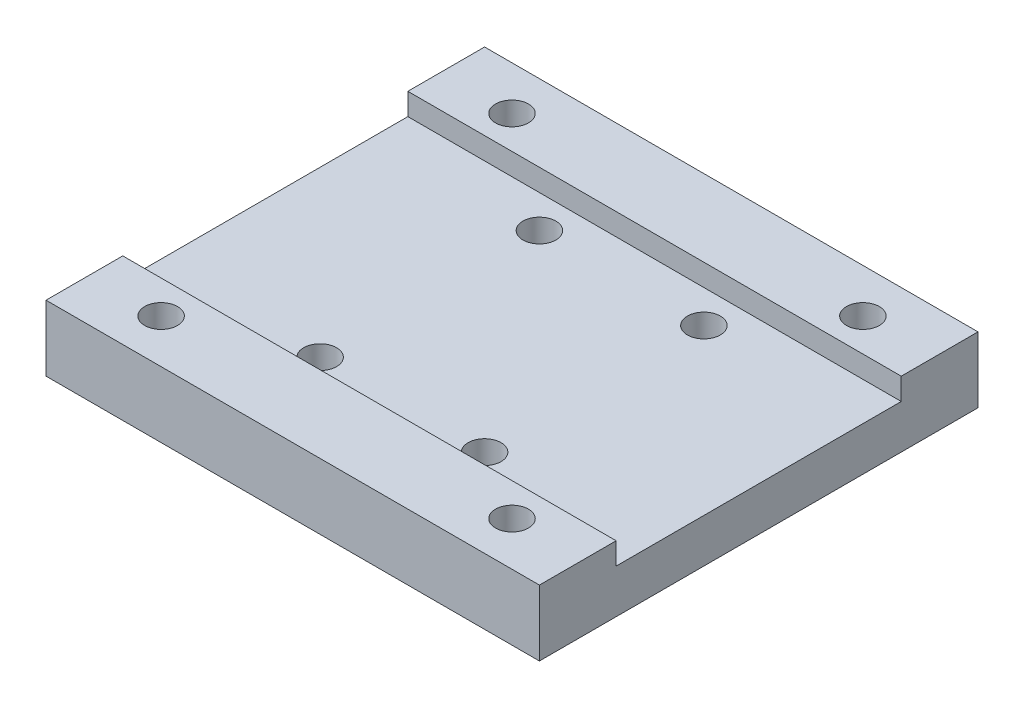
ISO-10303-21;
HEADER;
FILE_DESCRIPTION(('STEP AP214'),'2;1');
FILE_NAME('part.step','',(''),(''),'','','');
FILE_SCHEMA(('AUTOMOTIVE_DESIGN { 1 0 10303 214 1 1 1 1 }'));
ENDSEC;
DATA;
#1=APPLICATION_CONTEXT('core data for automotive mechanical design processes');
#2=APPLICATION_PROTOCOL_DEFINITION('international standard','automotive_design',2000,#1);
#3=PRODUCT_CONTEXT('',#1,'mechanical');
#4=PRODUCT('Part','Part','',(#3));
#5=PRODUCT_RELATED_PRODUCT_CATEGORY('part','',(#4));
#6=PRODUCT_DEFINITION_FORMATION('','',#4);
#7=PRODUCT_DEFINITION_CONTEXT('part definition',#1,'design');
#8=PRODUCT_DEFINITION('design','',#6,#7);
#9=PRODUCT_DEFINITION_SHAPE('','',#8);
#10=(LENGTH_UNIT() NAMED_UNIT(*) SI_UNIT(.MILLI.,.METRE.));
#11=(NAMED_UNIT(*) PLANE_ANGLE_UNIT() SI_UNIT($,.RADIAN.));
#12=(NAMED_UNIT(*) SI_UNIT($,.STERADIAN.) SOLID_ANGLE_UNIT());
#13=UNCERTAINTY_MEASURE_WITH_UNIT(LENGTH_MEASURE(1.E-05),#10,'distance_accuracy_value','');
#14=(GEOMETRIC_REPRESENTATION_CONTEXT(3) GLOBAL_UNCERTAINTY_ASSIGNED_CONTEXT((#13)) GLOBAL_UNIT_ASSIGNED_CONTEXT((#10,
#11,#12)) REPRESENTATION_CONTEXT('',''));
#15=CARTESIAN_POINT('',(0.,0.,0.));
#16=DIRECTION('',(0.,0.,1.));
#17=DIRECTION('',(1.,0.,0.));
#18=AXIS2_PLACEMENT_3D('',#15,#16,#17);
#19=CARTESIAN_POINT('',(0.,6.,0.));
#20=DIRECTION('',(0.,1.,0.));
#21=DIRECTION('',(0.,0.,1.));
#22=AXIS2_PLACEMENT_3D('',#19,#20,#21);
#23=PLANE('',#22);
#24=CARTESIAN_POINT('',(16.,6.,16.));
#25=DIRECTION('',(0.,1.,0.));
#26=DIRECTION('',(0.,0.,1.));
#27=AXIS2_PLACEMENT_3D('',#24,#25,#26);
#28=CIRCLE('',#27,1.5);
#29=CARTESIAN_POINT('',(16.,6.,17.5));
#30=VERTEX_POINT('',#29);
#31=EDGE_CURVE('E155',#30,#30,#28,.T.);
#32=ORIENTED_EDGE('',*,*,#31,.F.);
#33=EDGE_LOOP('',(#32));
#34=FACE_BOUND('',#33,.T.);
#35=CARTESIAN_POINT('',(-16.,6.,16.));
#36=DIRECTION('',(0.,1.,0.));
#37=DIRECTION('',(0.,0.,1.));
#38=AXIS2_PLACEMENT_3D('',#35,#36,#37);
#39=CIRCLE('',#38,1.5);
#40=CARTESIAN_POINT('',(-16.,6.,17.5));
#41=VERTEX_POINT('',#40);
#42=EDGE_CURVE('E158',#41,#41,#39,.T.);
#43=ORIENTED_EDGE('',*,*,#42,.F.);
#44=EDGE_LOOP('',(#43));
#45=FACE_BOUND('',#44,.T.);
#46=DIRECTION('',(0.,0.,-1.));
#47=VECTOR('',#46,1.);
#48=CARTESIAN_POINT('',(22.5,6.,16.5));
#49=LINE('',#48,#47);
#50=CARTESIAN_POINT('',(22.5,6.,20.));
#51=VERTEX_POINT('',#50);
#52=CARTESIAN_POINT('',(22.5,6.,13.));
#53=VERTEX_POINT('',#52);
#54=EDGE_CURVE('E11',#51,#53,#49,.T.);
#55=ORIENTED_EDGE('',*,*,#54,.T.);
#56=DIRECTION('',(1.,0.,0.));
#57=VECTOR('',#56,1.);
#58=CARTESIAN_POINT('',(22.5,6.,13.));
#59=LINE('',#58,#57);
#60=CARTESIAN_POINT('',(-22.5,6.,13.));
#61=VERTEX_POINT('',#60);
#62=EDGE_CURVE('E162',#61,#53,#59,.T.);
#63=ORIENTED_EDGE('',*,*,#62,.F.);
#64=DIRECTION('',(0.,0.,1.));
#65=VECTOR('',#64,1.);
#66=CARTESIAN_POINT('',(-22.5,6.,-16.5));
#67=LINE('',#66,#65);
#68=CARTESIAN_POINT('',(-22.5,6.,20.));
#69=VERTEX_POINT('',#68);
#70=EDGE_CURVE('E231',#61,#69,#67,.T.);
#71=ORIENTED_EDGE('',*,*,#70,.T.);
#72=DIRECTION('',(-1.,0.,0.));
#73=VECTOR('',#72,1.);
#74=CARTESIAN_POINT('',(22.5,6.,20.));
#75=LINE('',#74,#73);
#76=EDGE_CURVE('E194',#51,#69,#75,.T.);
#77=ORIENTED_EDGE('',*,*,#76,.F.);
#78=EDGE_LOOP('',(#55,#63,#71,#77));
#79=FACE_BOUND('',#78,.T.);
#80=ADVANCED_FACE('F39',(#34,#45,#79),#23,.T.);
#81=CARTESIAN_POINT('',(-16.,6.,-16.));
#82=DIRECTION('',(0.,1.,0.));
#83=DIRECTION('',(0.,0.,1.));
#84=AXIS2_PLACEMENT_3D('',#81,#82,#83);
#85=CIRCLE('',#84,1.5);
#86=CARTESIAN_POINT('',(-16.,6.,-14.5));
#87=VERTEX_POINT('',#86);
#88=EDGE_CURVE('E149',#87,#87,#85,.T.);
#89=ORIENTED_EDGE('',*,*,#88,.F.);
#90=EDGE_LOOP('',(#89));
#91=FACE_BOUND('',#90,.T.);
#92=CARTESIAN_POINT('',(16.,6.,-16.));
#93=DIRECTION('',(0.,1.,0.));
#94=DIRECTION('',(0.,0.,1.));
#95=AXIS2_PLACEMENT_3D('',#92,#93,#94);
#96=CIRCLE('',#95,1.5);
#97=CARTESIAN_POINT('',(16.,6.,-14.5));
#98=VERTEX_POINT('',#97);
#99=EDGE_CURVE('E152',#98,#98,#96,.T.);
#100=ORIENTED_EDGE('',*,*,#99,.F.);
#101=EDGE_LOOP('',(#100));
#102=FACE_BOUND('',#101,.T.);
#103=CARTESIAN_POINT('',(-22.5,6.,-20.));
#104=VERTEX_POINT('',#103);
#105=CARTESIAN_POINT('',(-22.5,6.,-13.));
#106=VERTEX_POINT('',#105);
#107=EDGE_CURVE('E230',#104,#106,#67,.T.);
#108=ORIENTED_EDGE('',*,*,#107,.T.);
#109=DIRECTION('',(-1.,0.,0.));
#110=VECTOR('',#109,1.);
#111=CARTESIAN_POINT('',(-22.5,6.,-13.));
#112=LINE('',#111,#110);
#113=CARTESIAN_POINT('',(22.5,6.,-13.));
#114=VERTEX_POINT('',#113);
#115=EDGE_CURVE('E172',#114,#106,#112,.T.);
#116=ORIENTED_EDGE('',*,*,#115,.F.);
#117=CARTESIAN_POINT('',(22.5,6.,-20.));
#118=VERTEX_POINT('',#117);
#119=EDGE_CURVE('E48',#114,#118,#49,.T.);
#120=ORIENTED_EDGE('',*,*,#119,.T.);
#121=DIRECTION('',(1.,0.,0.));
#122=VECTOR('',#121,1.);
#123=CARTESIAN_POINT('',(-22.5,6.,-20.));
#124=LINE('',#123,#122);
#125=EDGE_CURVE('E206',#104,#118,#124,.T.);
#126=ORIENTED_EDGE('',*,*,#125,.F.);
#127=EDGE_LOOP('',(#108,#116,#120,#126));
#128=FACE_BOUND('',#127,.T.);
#129=ADVANCED_FACE('F257',(#91,#102,#128),#23,.T.);
#130=CARTESIAN_POINT('',(0.,0.,0.));
#131=DIRECTION('',(0.,1.,0.));
#132=DIRECTION('',(0.,0.,1.));
#133=AXIS2_PLACEMENT_3D('',#130,#131,#132);
#134=PLANE('',#133);
#135=CARTESIAN_POINT('',(16.,0.,-16.));
#136=DIRECTION('',(0.,-1.,0.));
#137=DIRECTION('',(0.,0.,-1.));
#138=AXIS2_PLACEMENT_3D('',#135,#136,#137);
#139=CIRCLE('',#138,3.);
#140=CARTESIAN_POINT('',(16.,0.,-19.));
#141=VERTEX_POINT('',#140);
#142=EDGE_CURVE('E623',#141,#141,#139,.T.);
#143=ORIENTED_EDGE('',*,*,#142,.F.);
#144=EDGE_LOOP('',(#143));
#145=FACE_BOUND('',#144,.T.);
#146=CARTESIAN_POINT('',(-16.,0.,-16.));
#147=DIRECTION('',(0.,-1.,0.));
#148=DIRECTION('',(0.,0.,-1.));
#149=AXIS2_PLACEMENT_3D('',#146,#147,#148);
#150=CIRCLE('',#149,3.);
#151=CARTESIAN_POINT('',(-16.,0.,-19.));
#152=VERTEX_POINT('',#151);
#153=EDGE_CURVE('E630',#152,#152,#150,.T.);
#154=ORIENTED_EDGE('',*,*,#153,.F.);
#155=EDGE_LOOP('',(#154));
#156=FACE_BOUND('',#155,.T.);
#157=CARTESIAN_POINT('',(-16.,0.,16.));
#158=DIRECTION('',(0.,-1.,0.));
#159=DIRECTION('',(0.,0.,-1.));
#160=AXIS2_PLACEMENT_3D('',#157,#158,#159);
#161=CIRCLE('',#160,3.);
#162=CARTESIAN_POINT('',(-16.,0.,13.));
#163=VERTEX_POINT('',#162);
#164=EDGE_CURVE('E639',#163,#163,#161,.T.);
#165=ORIENTED_EDGE('',*,*,#164,.F.);
#166=EDGE_LOOP('',(#165));
#167=FACE_BOUND('',#166,.T.);
#168=CARTESIAN_POINT('',(16.,0.,16.));
#169=DIRECTION('',(0.,-1.,0.));
#170=DIRECTION('',(0.,0.,-1.));
#171=AXIS2_PLACEMENT_3D('',#168,#169,#170);
#172=CIRCLE('',#171,3.);
#173=CARTESIAN_POINT('',(16.,0.,13.));
#174=VERTEX_POINT('',#173);
#175=EDGE_CURVE('E648',#174,#174,#172,.T.);
#176=ORIENTED_EDGE('',*,*,#175,.F.);
#177=EDGE_LOOP('',(#176));
#178=FACE_BOUND('',#177,.T.);
#179=CARTESIAN_POINT('',(-3.50000000000004,0.,17.));
#180=DIRECTION('',(0.,-1.,0.));
#181=DIRECTION('',(0.,0.,-1.));
#182=AXIS2_PLACEMENT_3D('',#179,#180,#181);
#183=CIRCLE('',#182,1.24999999999999);
#184=CARTESIAN_POINT('',(-3.50000000000004,0.,15.75));
#185=VERTEX_POINT('',#184);
#186=EDGE_CURVE('E125',#185,#185,#183,.T.);
#187=ORIENTED_EDGE('',*,*,#186,.F.);
#188=EDGE_LOOP('',(#187));
#189=FACE_BOUND('',#188,.T.);
#190=CARTESIAN_POINT('',(3.49999999999996,0.,17.));
#191=DIRECTION('',(0.,-1.,0.));
#192=DIRECTION('',(0.,0.,-1.));
#193=AXIS2_PLACEMENT_3D('',#190,#191,#192);
#194=CIRCLE('',#193,1.24999999999999);
#195=CARTESIAN_POINT('',(3.49999999999996,0.,15.75));
#196=VERTEX_POINT('',#195);
#197=EDGE_CURVE('E124',#196,#196,#194,.T.);
#198=ORIENTED_EDGE('',*,*,#197,.F.);
#199=EDGE_LOOP('',(#198));
#200=FACE_BOUND('',#199,.T.);
#201=CARTESIAN_POINT('',(3.49999999999996,0.,-16.9999999999999));
#202=DIRECTION('',(0.,-1.,0.));
#203=DIRECTION('',(0.,0.,-1.));
#204=AXIS2_PLACEMENT_3D('',#201,#202,#203);
#205=CIRCLE('',#204,1.24999999999999);
#206=CARTESIAN_POINT('',(3.49999999999996,0.,-18.2499999999999));
#207=VERTEX_POINT('',#206);
#208=EDGE_CURVE('E137',#207,#207,#205,.T.);
#209=ORIENTED_EDGE('',*,*,#208,.F.);
#210=EDGE_LOOP('',(#209));
#211=FACE_BOUND('',#210,.T.);
#212=CARTESIAN_POINT('',(-3.50000000000003,0.,-16.9999999999999));
#213=DIRECTION('',(0.,-1.,0.));
#214=DIRECTION('',(0.,0.,-1.));
#215=AXIS2_PLACEMENT_3D('',#212,#213,#214);
#216=CIRCLE('',#215,1.24999999999999);
#217=CARTESIAN_POINT('',(-3.50000000000003,0.,-18.2499999999999));
#218=VERTEX_POINT('',#217);
#219=EDGE_CURVE('E143',#218,#218,#216,.T.);
#220=ORIENTED_EDGE('',*,*,#219,.F.);
#221=EDGE_LOOP('',(#220));
#222=FACE_BOUND('',#221,.T.);
#223=DIRECTION('',(0.,0.,1.));
#224=VECTOR('',#223,1.);
#225=CARTESIAN_POINT('',(-22.5,0.,-16.5));
#226=LINE('',#225,#224);
#227=CARTESIAN_POINT('',(-22.5,0.,-20.));
#228=VERTEX_POINT('',#227);
#229=CARTESIAN_POINT('',(-22.5,0.,20.));
#230=VERTEX_POINT('',#229);
#231=EDGE_CURVE('E229',#228,#230,#226,.T.);
#232=ORIENTED_EDGE('',*,*,#231,.F.);
#233=DIRECTION('',(1.,0.,0.));
#234=VECTOR('',#233,1.);
#235=CARTESIAN_POINT('',(-22.5,0.,-20.));
#236=LINE('',#235,#234);
#237=CARTESIAN_POINT('',(22.5,0.,-20.));
#238=VERTEX_POINT('',#237);
#239=EDGE_CURVE('E203',#228,#238,#236,.T.);
#240=ORIENTED_EDGE('',*,*,#239,.T.);
#241=DIRECTION('',(0.,0.,-1.));
#242=VECTOR('',#241,1.);
#243=CARTESIAN_POINT('',(22.5,0.,16.5));
#244=LINE('',#243,#242);
#245=CARTESIAN_POINT('',(22.5,0.,20.));
#246=VERTEX_POINT('',#245);
#247=EDGE_CURVE('E233',#246,#238,#244,.T.);
#248=ORIENTED_EDGE('',*,*,#247,.F.);
#249=DIRECTION('',(-1.,0.,0.));
#250=VECTOR('',#249,1.);
#251=CARTESIAN_POINT('',(22.5,0.,20.));
#252=LINE('',#251,#250);
#253=EDGE_CURVE('E193',#246,#230,#252,.T.);
#254=ORIENTED_EDGE('',*,*,#253,.T.);
#255=EDGE_LOOP('',(#232,#240,#248,#254));
#256=FACE_BOUND('',#255,.T.);
#257=CARTESIAN_POINT('',(-7.49999999999996,0.,-10.));
#258=DIRECTION('',(0.,1.,0.));
#259=DIRECTION('',(0.,0.,1.));
#260=AXIS2_PLACEMENT_3D('',#257,#258,#259);
#261=CIRCLE('',#260,1.5);
#262=CARTESIAN_POINT('',(-7.49999999999996,0.,-8.50000000000001));
#263=VERTEX_POINT('',#262);
#264=EDGE_CURVE('E226',#263,#263,#261,.T.);
#265=ORIENTED_EDGE('',*,*,#264,.T.);
#266=EDGE_LOOP('',(#265));
#267=FACE_BOUND('',#266,.T.);
#268=CARTESIAN_POINT('',(7.50000000000004,0.,-10.));
#269=DIRECTION('',(0.,1.,0.));
#270=DIRECTION('',(0.,0.,1.));
#271=AXIS2_PLACEMENT_3D('',#268,#269,#270);
#272=CIRCLE('',#271,1.5);
#273=CARTESIAN_POINT('',(7.50000000000004,0.,-8.50000000000001));
#274=VERTEX_POINT('',#273);
#275=EDGE_CURVE('E223',#274,#274,#272,.T.);
#276=ORIENTED_EDGE('',*,*,#275,.T.);
#277=EDGE_LOOP('',(#276));
#278=FACE_BOUND('',#277,.T.);
#279=CARTESIAN_POINT('',(-7.5,0.,10.));
#280=DIRECTION('',(0.,1.,0.));
#281=DIRECTION('',(0.,0.,1.));
#282=AXIS2_PLACEMENT_3D('',#279,#280,#281);
#283=CIRCLE('',#282,1.5);
#284=CARTESIAN_POINT('',(-7.5,0.,11.5));
#285=VERTEX_POINT('',#284);
#286=EDGE_CURVE('E220',#285,#285,#283,.T.);
#287=ORIENTED_EDGE('',*,*,#286,.T.);
#288=EDGE_LOOP('',(#287));
#289=FACE_BOUND('',#288,.T.);
#290=CARTESIAN_POINT('',(7.5,0.,10.));
#291=DIRECTION('',(0.,1.,0.));
#292=DIRECTION('',(0.,0.,1.));
#293=AXIS2_PLACEMENT_3D('',#290,#291,#292);
#294=CIRCLE('',#293,1.5);
#295=CARTESIAN_POINT('',(7.5,0.,11.5));
#296=VERTEX_POINT('',#295);
#297=EDGE_CURVE('E215',#296,#296,#294,.T.);
#298=ORIENTED_EDGE('',*,*,#297,.T.);
#299=EDGE_LOOP('',(#298));
#300=FACE_BOUND('',#299,.T.);
#301=ADVANCED_FACE('F264',(#145,#156,#167,#178,#189,#200,#211,#222,#256,#267,#278,#289,#300),
#134,.F.);
#302=CARTESIAN_POINT('',(-22.5,6.,-16.5));
#303=DIRECTION('',(1.,0.,0.));
#304=DIRECTION('',(0.,0.,-1.));
#305=AXIS2_PLACEMENT_3D('',#302,#303,#304);
#306=PLANE('',#305);
#307=ORIENTED_EDGE('',*,*,#70,.F.);
#308=DIRECTION('',(0.,-1.,0.));
#309=VECTOR('',#308,1.);
#310=CARTESIAN_POINT('',(-22.5,51.13590588434,13.));
#311=LINE('',#310,#309);
#312=CARTESIAN_POINT('',(-22.5,4.,13.));
#313=VERTEX_POINT('',#312);
#314=EDGE_CURVE('E168',#61,#313,#311,.T.);
#315=ORIENTED_EDGE('',*,*,#314,.T.);
#316=DIRECTION('',(0.,0.,1.));
#317=VECTOR('',#316,1.);
#318=CARTESIAN_POINT('',(-22.5,4.,13.75));
#319=LINE('',#318,#317);
#320=CARTESIAN_POINT('',(-22.5,4.,-13.));
#321=VERTEX_POINT('',#320);
#322=EDGE_CURVE('E56',#321,#313,#319,.T.);
#323=ORIENTED_EDGE('',*,*,#322,.F.);
#324=DIRECTION('',(0.,-1.,0.));
#325=VECTOR('',#324,1.);
#326=CARTESIAN_POINT('',(-22.5,51.13590588434,-13.));
#327=LINE('',#326,#325);
#328=EDGE_CURVE('E175',#106,#321,#327,.T.);
#329=ORIENTED_EDGE('',*,*,#328,.F.);
#330=ORIENTED_EDGE('',*,*,#107,.F.);
#331=DIRECTION('',(0.,-1.,0.));
#332=VECTOR('',#331,1.);
#333=CARTESIAN_POINT('',(-22.5,6.,-20.));
#334=LINE('',#333,#332);
#335=EDGE_CURVE('E209',#104,#228,#334,.T.);
#336=ORIENTED_EDGE('',*,*,#335,.T.);
#337=ORIENTED_EDGE('',*,*,#231,.T.);
#338=DIRECTION('',(0.,-1.,0.));
#339=VECTOR('',#338,1.);
#340=CARTESIAN_POINT('',(-22.5,6.,20.));
#341=LINE('',#340,#339);
#342=EDGE_CURVE('E200',#69,#230,#341,.T.);
#343=ORIENTED_EDGE('',*,*,#342,.F.);
#344=EDGE_LOOP('',(#307,#315,#323,#329,#330,#336,#337,#343));
#345=FACE_BOUND('',#344,.T.);
#346=ADVANCED_FACE('F41',(#345),#306,.F.);
#347=CARTESIAN_POINT('',(22.5,6.,16.5));
#348=DIRECTION('',(-1.,0.,0.));
#349=DIRECTION('',(0.,0.,1.));
#350=AXIS2_PLACEMENT_3D('',#347,#348,#349);
#351=PLANE('',#350);
#352=DIRECTION('',(0.,-1.,0.));
#353=VECTOR('',#352,1.);
#354=CARTESIAN_POINT('',(22.5,51.13590588434,13.));
#355=LINE('',#354,#353);
#356=CARTESIAN_POINT('',(22.5,4.,13.));
#357=VERTEX_POINT('',#356);
#358=EDGE_CURVE('E165',#53,#357,#355,.T.);
#359=ORIENTED_EDGE('',*,*,#358,.F.);
#360=ORIENTED_EDGE('',*,*,#54,.F.);
#361=DIRECTION('',(0.,-1.,0.));
#362=VECTOR('',#361,1.);
#363=CARTESIAN_POINT('',(22.5,6.,20.));
#364=LINE('',#363,#362);
#365=EDGE_CURVE('E197',#51,#246,#364,.T.);
#366=ORIENTED_EDGE('',*,*,#365,.T.);
#367=ORIENTED_EDGE('',*,*,#247,.T.);
#368=DIRECTION('',(0.,-1.,0.));
#369=VECTOR('',#368,1.);
#370=CARTESIAN_POINT('',(22.5,6.,-20.));
#371=LINE('',#370,#369);
#372=EDGE_CURVE('E212',#118,#238,#371,.T.);
#373=ORIENTED_EDGE('',*,*,#372,.F.);
#374=ORIENTED_EDGE('',*,*,#119,.F.);
#375=DIRECTION('',(0.,-1.,0.));
#376=VECTOR('',#375,1.);
#377=CARTESIAN_POINT('',(22.5,51.13590588434,-13.));
#378=LINE('',#377,#376);
#379=CARTESIAN_POINT('',(22.5,4.,-13.));
#380=VERTEX_POINT('',#379);
#381=EDGE_CURVE('E178',#114,#380,#378,.T.);
#382=ORIENTED_EDGE('',*,*,#381,.T.);
#383=DIRECTION('',(0.,0.,-1.));
#384=VECTOR('',#383,1.);
#385=CARTESIAN_POINT('',(22.5,4.,-13.75));
#386=LINE('',#385,#384);
#387=EDGE_CURVE('E181',#357,#380,#386,.T.);
#388=ORIENTED_EDGE('',*,*,#387,.F.);
#389=EDGE_LOOP('',(#359,#360,#366,#367,#373,#374,#382,#388));
#390=FACE_BOUND('',#389,.T.);
#391=ADVANCED_FACE('F247',(#390),#351,.F.);
#392=CARTESIAN_POINT('',(-7.49999999999996,6.,-10.));
#393=DIRECTION('',(0.,-1.,0.));
#394=DIRECTION('',(0.,0.,-1.));
#395=AXIS2_PLACEMENT_3D('',#392,#393,#394);
#396=CYLINDRICAL_SURFACE('',#395,1.5);
#397=CARTESIAN_POINT('',(-7.49999999999996,4.,-10.));
#398=DIRECTION('',(0.,-1.,0.));
#399=DIRECTION('',(0.,0.,-1.));
#400=AXIS2_PLACEMENT_3D('',#397,#398,#399);
#401=CIRCLE('',#400,1.5);
#402=CARTESIAN_POINT('',(-7.49999999999996,4.,-11.5));
#403=VERTEX_POINT('',#402);
#404=EDGE_CURVE('E190',#403,#403,#401,.T.);
#405=ORIENTED_EDGE('',*,*,#404,.F.);
#406=EDGE_LOOP('',(#405));
#407=FACE_BOUND('',#406,.T.);
#408=ORIENTED_EDGE('',*,*,#264,.F.);
#409=EDGE_LOOP('',(#408));
#410=FACE_BOUND('',#409,.T.);
#411=ADVANCED_FACE('F301',(#407,#410),#396,.F.);
#412=CARTESIAN_POINT('',(7.50000000000004,6.,-10.));
#413=DIRECTION('',(0.,-1.,0.));
#414=DIRECTION('',(0.,0.,-1.));
#415=AXIS2_PLACEMENT_3D('',#412,#413,#414);
#416=CYLINDRICAL_SURFACE('',#415,1.5);
#417=CARTESIAN_POINT('',(7.50000000000004,4.,-10.));
#418=DIRECTION('',(0.,-1.,0.));
#419=DIRECTION('',(0.,0.,-1.));
#420=AXIS2_PLACEMENT_3D('',#417,#418,#419);
#421=CIRCLE('',#420,1.5);
#422=CARTESIAN_POINT('',(7.50000000000004,4.,-11.5));
#423=VERTEX_POINT('',#422);
#424=EDGE_CURVE('E187',#423,#423,#421,.T.);
#425=ORIENTED_EDGE('',*,*,#424,.F.);
#426=EDGE_LOOP('',(#425));
#427=FACE_BOUND('',#426,.T.);
#428=ORIENTED_EDGE('',*,*,#275,.F.);
#429=EDGE_LOOP('',(#428));
#430=FACE_BOUND('',#429,.T.);
#431=ADVANCED_FACE('F287',(#427,#430),#416,.F.);
#432=CARTESIAN_POINT('',(-7.5,6.,10.));
#433=DIRECTION('',(0.,-1.,0.));
#434=DIRECTION('',(0.,0.,-1.));
#435=AXIS2_PLACEMENT_3D('',#432,#433,#434);
#436=CYLINDRICAL_SURFACE('',#435,1.5);
#437=CARTESIAN_POINT('',(-7.5,4.,10.));
#438=DIRECTION('',(0.,-1.,0.));
#439=DIRECTION('',(0.,0.,-1.));
#440=AXIS2_PLACEMENT_3D('',#437,#438,#439);
#441=CIRCLE('',#440,1.5);
#442=CARTESIAN_POINT('',(-7.5,4.,8.5));
#443=VERTEX_POINT('',#442);
#444=EDGE_CURVE('E184',#443,#443,#441,.T.);
#445=ORIENTED_EDGE('',*,*,#444,.F.);
#446=EDGE_LOOP('',(#445));
#447=FACE_BOUND('',#446,.T.);
#448=ORIENTED_EDGE('',*,*,#286,.F.);
#449=EDGE_LOOP('',(#448));
#450=FACE_BOUND('',#449,.T.);
#451=ADVANCED_FACE('F279',(#447,#450),#436,.F.);
#452=CARTESIAN_POINT('',(7.5,6.,10.));
#453=DIRECTION('',(0.,-1.,0.));
#454=DIRECTION('',(0.,0.,-1.));
#455=AXIS2_PLACEMENT_3D('',#452,#453,#454);
#456=CYLINDRICAL_SURFACE('',#455,1.5);
#457=CARTESIAN_POINT('',(7.5,4.,10.));
#458=DIRECTION('',(0.,-1.,0.));
#459=DIRECTION('',(0.,0.,-1.));
#460=AXIS2_PLACEMENT_3D('',#457,#458,#459);
#461=CIRCLE('',#460,1.5);
#462=CARTESIAN_POINT('',(7.5,4.,8.5));
#463=VERTEX_POINT('',#462);
#464=EDGE_CURVE('E43',#463,#463,#461,.T.);
#465=ORIENTED_EDGE('',*,*,#464,.F.);
#466=EDGE_LOOP('',(#465));
#467=FACE_BOUND('',#466,.T.);
#468=ORIENTED_EDGE('',*,*,#297,.F.);
#469=EDGE_LOOP('',(#468));
#470=FACE_BOUND('',#469,.T.);
#471=ADVANCED_FACE('F277',(#467,#470),#456,.F.);
#472=CARTESIAN_POINT('',(-22.5,6.,-20.));
#473=DIRECTION('',(0.,0.,-1.));
#474=DIRECTION('',(-1.,0.,0.));
#475=AXIS2_PLACEMENT_3D('',#472,#473,#474);
#476=PLANE('',#475);
#477=ORIENTED_EDGE('',*,*,#239,.F.);
#478=ORIENTED_EDGE('',*,*,#335,.F.);
#479=ORIENTED_EDGE('',*,*,#125,.T.);
#480=ORIENTED_EDGE('',*,*,#372,.T.);
#481=EDGE_LOOP('',(#477,#478,#479,#480));
#482=FACE_BOUND('',#481,.T.);
#483=ADVANCED_FACE('F262',(#482),#476,.T.);
#484=CARTESIAN_POINT('',(22.5,6.,20.));
#485=DIRECTION('',(0.,0.,1.));
#486=DIRECTION('',(1.,0.,0.));
#487=AXIS2_PLACEMENT_3D('',#484,#485,#486);
#488=PLANE('',#487);
#489=ORIENTED_EDGE('',*,*,#253,.F.);
#490=ORIENTED_EDGE('',*,*,#365,.F.);
#491=ORIENTED_EDGE('',*,*,#76,.T.);
#492=ORIENTED_EDGE('',*,*,#342,.T.);
#493=EDGE_LOOP('',(#489,#490,#491,#492));
#494=FACE_BOUND('',#493,.T.);
#495=ADVANCED_FACE('F245',(#494),#488,.T.);
#496=CARTESIAN_POINT('',(0.,4.,0.));
#497=DIRECTION('',(0.,-1.,0.));
#498=DIRECTION('',(0.,0.,-1.));
#499=AXIS2_PLACEMENT_3D('',#496,#497,#498);
#500=PLANE('',#499);
#501=ORIENTED_EDGE('',*,*,#404,.T.);
#502=EDGE_LOOP('',(#501));
#503=FACE_BOUND('',#502,.T.);
#504=ORIENTED_EDGE('',*,*,#424,.T.);
#505=EDGE_LOOP('',(#504));
#506=FACE_BOUND('',#505,.T.);
#507=ORIENTED_EDGE('',*,*,#444,.T.);
#508=EDGE_LOOP('',(#507));
#509=FACE_BOUND('',#508,.T.);
#510=ORIENTED_EDGE('',*,*,#464,.T.);
#511=EDGE_LOOP('',(#510));
#512=FACE_BOUND('',#511,.T.);
#513=ORIENTED_EDGE('',*,*,#322,.T.);
#514=DIRECTION('',(1.,0.,0.));
#515=VECTOR('',#514,1.);
#516=CARTESIAN_POINT('',(22.5,4.,13.));
#517=LINE('',#516,#515);
#518=EDGE_CURVE('E61',#313,#357,#517,.T.);
#519=ORIENTED_EDGE('',*,*,#518,.T.);
#520=ORIENTED_EDGE('',*,*,#387,.T.);
#521=DIRECTION('',(-1.,0.,0.));
#522=VECTOR('',#521,1.);
#523=CARTESIAN_POINT('',(-22.5,4.,-13.));
#524=LINE('',#523,#522);
#525=EDGE_CURVE('E170',#380,#321,#524,.T.);
#526=ORIENTED_EDGE('',*,*,#525,.T.);
#527=EDGE_LOOP('',(#513,#519,#520,#526));
#528=FACE_BOUND('',#527,.T.);
#529=ADVANCED_FACE('F459',(#503,#506,#509,#512,#528),#500,.F.);
#530=CARTESIAN_POINT('',(-22.5,51.13590588434,-13.));
#531=DIRECTION('',(0.,0.,1.));
#532=DIRECTION('',(1.,0.,0.));
#533=AXIS2_PLACEMENT_3D('',#530,#531,#532);
#534=PLANE('',#533);
#535=ORIENTED_EDGE('',*,*,#381,.F.);
#536=ORIENTED_EDGE('',*,*,#115,.T.);
#537=ORIENTED_EDGE('',*,*,#328,.T.);
#538=ORIENTED_EDGE('',*,*,#525,.F.);
#539=EDGE_LOOP('',(#535,#536,#537,#538));
#540=FACE_BOUND('',#539,.T.);
#541=ADVANCED_FACE('F254',(#540),#534,.T.);
#542=CARTESIAN_POINT('',(22.5,51.13590588434,13.));
#543=DIRECTION('',(0.,0.,-1.));
#544=DIRECTION('',(-1.,0.,0.));
#545=AXIS2_PLACEMENT_3D('',#542,#543,#544);
#546=PLANE('',#545);
#547=ORIENTED_EDGE('',*,*,#314,.F.);
#548=ORIENTED_EDGE('',*,*,#62,.T.);
#549=ORIENTED_EDGE('',*,*,#358,.T.);
#550=ORIENTED_EDGE('',*,*,#518,.F.);
#551=EDGE_LOOP('',(#547,#548,#549,#550));
#552=FACE_BOUND('',#551,.T.);
#553=ADVANCED_FACE('F249',(#552),#546,.T.);
#554=CARTESIAN_POINT('',(-16.,6.,16.));
#555=DIRECTION('',(0.,1.,0.));
#556=DIRECTION('',(0.,0.,1.));
#557=AXIS2_PLACEMENT_3D('',#554,#555,#556);
#558=CYLINDRICAL_SURFACE('',#557,1.5);
#559=CARTESIAN_POINT('',(-16.,3.,16.));
#560=DIRECTION('',(0.,-1.,0.));
#561=DIRECTION('',(0.,0.,-1.));
#562=AXIS2_PLACEMENT_3D('',#559,#560,#561);
#563=CIRCLE('',#562,1.5);
#564=CARTESIAN_POINT('',(-16.,3.,14.5));
#565=VERTEX_POINT('',#564);
#566=EDGE_CURVE('E645',#565,#565,#563,.T.);
#567=ORIENTED_EDGE('',*,*,#566,.T.);
#568=EDGE_LOOP('',(#567));
#569=FACE_BOUND('',#568,.T.);
#570=ORIENTED_EDGE('',*,*,#42,.T.);
#571=EDGE_LOOP('',(#570));
#572=FACE_BOUND('',#571,.T.);
#573=ADVANCED_FACE('F437',(#569,#572),#558,.F.);
#574=CARTESIAN_POINT('',(16.,6.,16.));
#575=DIRECTION('',(0.,1.,0.));
#576=DIRECTION('',(0.,0.,1.));
#577=AXIS2_PLACEMENT_3D('',#574,#575,#576);
#578=CYLINDRICAL_SURFACE('',#577,1.5);
#579=CARTESIAN_POINT('',(16.,3.,16.));
#580=DIRECTION('',(0.,-1.,0.));
#581=DIRECTION('',(0.,0.,-1.));
#582=AXIS2_PLACEMENT_3D('',#579,#580,#581);
#583=CIRCLE('',#582,1.5);
#584=CARTESIAN_POINT('',(16.,3.,14.5));
#585=VERTEX_POINT('',#584);
#586=EDGE_CURVE('E131',#585,#585,#583,.T.);
#587=ORIENTED_EDGE('',*,*,#586,.T.);
#588=EDGE_LOOP('',(#587));
#589=FACE_BOUND('',#588,.T.);
#590=ORIENTED_EDGE('',*,*,#31,.T.);
#591=EDGE_LOOP('',(#590));
#592=FACE_BOUND('',#591,.T.);
#593=ADVANCED_FACE('F427',(#589,#592),#578,.F.);
#594=CARTESIAN_POINT('',(16.,6.,-16.));
#595=DIRECTION('',(0.,1.,0.));
#596=DIRECTION('',(0.,0.,1.));
#597=AXIS2_PLACEMENT_3D('',#594,#595,#596);
#598=CYLINDRICAL_SURFACE('',#597,1.5);
#599=CARTESIAN_POINT('',(16.,3.,-16.));
#600=DIRECTION('',(0.,-1.,0.));
#601=DIRECTION('',(0.,0.,-1.));
#602=AXIS2_PLACEMENT_3D('',#599,#600,#601);
#603=CIRCLE('',#602,1.5);
#604=CARTESIAN_POINT('',(16.,3.,-17.5));
#605=VERTEX_POINT('',#604);
#606=EDGE_CURVE('E625',#605,#605,#603,.T.);
#607=ORIENTED_EDGE('',*,*,#606,.T.);
#608=EDGE_LOOP('',(#607));
#609=FACE_BOUND('',#608,.T.);
#610=ORIENTED_EDGE('',*,*,#99,.T.);
#611=EDGE_LOOP('',(#610));
#612=FACE_BOUND('',#611,.T.);
#613=ADVANCED_FACE('F417',(#609,#612),#598,.F.);
#614=CARTESIAN_POINT('',(-16.,6.,-16.));
#615=DIRECTION('',(0.,1.,0.));
#616=DIRECTION('',(0.,0.,1.));
#617=AXIS2_PLACEMENT_3D('',#614,#615,#616);
#618=CYLINDRICAL_SURFACE('',#617,1.5);
#619=CARTESIAN_POINT('',(-16.,3.,-16.));
#620=DIRECTION('',(0.,-1.,0.));
#621=DIRECTION('',(0.,0.,-1.));
#622=AXIS2_PLACEMENT_3D('',#619,#620,#621);
#623=CIRCLE('',#622,1.5);
#624=CARTESIAN_POINT('',(-16.,3.,-17.5));
#625=VERTEX_POINT('',#624);
#626=EDGE_CURVE('E636',#625,#625,#623,.T.);
#627=ORIENTED_EDGE('',*,*,#626,.T.);
#628=EDGE_LOOP('',(#627));
#629=FACE_BOUND('',#628,.T.);
#630=ORIENTED_EDGE('',*,*,#88,.T.);
#631=EDGE_LOOP('',(#630));
#632=FACE_BOUND('',#631,.T.);
#633=ADVANCED_FACE('F337',(#629,#632),#618,.F.);
#634=CARTESIAN_POINT('',(-3.50000000000003,4.,-16.9999999999999));
#635=DIRECTION('',(0.,-1.,0.));
#636=DIRECTION('',(0.,0.,-1.));
#637=AXIS2_PLACEMENT_3D('',#634,#635,#636);
#638=CONICAL_SURFACE('',#637,1.25,1.02974425867665);
#639=CARTESIAN_POINT('',(-3.50000000000003,4.75107577378445,-16.9999999999999));
#640=VERTEX_POINT('',#639);
#641=VERTEX_LOOP('',#640);
#642=FACE_BOUND('',#641,.T.);
#643=CARTESIAN_POINT('',(-3.50000000000003,4.,-16.9999999999999));
#644=DIRECTION('',(0.,-1.,0.));
#645=DIRECTION('',(0.,0.,-1.));
#646=AXIS2_PLACEMENT_3D('',#643,#644,#645);
#647=CIRCLE('',#646,1.25);
#648=CARTESIAN_POINT('',(-3.50000000000003,4.,-18.2499999999999));
#649=VERTEX_POINT('',#648);
#650=EDGE_CURVE('E146',#649,#649,#647,.T.);
#651=ORIENTED_EDGE('',*,*,#650,.T.);
#652=EDGE_LOOP('',(#651));
#653=FACE_BOUND('',#652,.T.);
#654=ADVANCED_FACE('F331',(#642,#653),#638,.F.);
#655=CARTESIAN_POINT('',(-3.50000000000003,0.,-16.9999999999999));
#656=DIRECTION('',(0.,-1.,0.));
#657=DIRECTION('',(0.,0.,-1.));
#658=AXIS2_PLACEMENT_3D('',#655,#656,#657);
#659=CYLINDRICAL_SURFACE('',#658,1.24999999999999);
#660=ORIENTED_EDGE('',*,*,#650,.F.);
#661=EDGE_LOOP('',(#660));
#662=FACE_BOUND('',#661,.T.);
#663=ORIENTED_EDGE('',*,*,#219,.T.);
#664=EDGE_LOOP('',(#663));
#665=FACE_BOUND('',#664,.T.);
#666=ADVANCED_FACE('F336',(#662,#665),#659,.F.);
#667=CARTESIAN_POINT('',(3.49999999999996,4.,-16.9999999999999));
#668=DIRECTION('',(0.,-1.,0.));
#669=DIRECTION('',(0.,0.,-1.));
#670=AXIS2_PLACEMENT_3D('',#667,#668,#669);
#671=CONICAL_SURFACE('',#670,1.25,1.02974425867665);
#672=CARTESIAN_POINT('',(3.49999999999996,4.75107577378445,-16.9999999999999));
#673=VERTEX_POINT('',#672);
#674=VERTEX_LOOP('',#673);
#675=FACE_BOUND('',#674,.T.);
#676=CARTESIAN_POINT('',(3.49999999999996,4.,-16.9999999999999));
#677=DIRECTION('',(0.,-1.,0.));
#678=DIRECTION('',(0.,0.,-1.));
#679=AXIS2_PLACEMENT_3D('',#676,#677,#678);
#680=CIRCLE('',#679,1.25);
#681=CARTESIAN_POINT('',(3.49999999999996,4.,-18.2499999999999));
#682=VERTEX_POINT('',#681);
#683=EDGE_CURVE('E140',#682,#682,#680,.T.);
#684=ORIENTED_EDGE('',*,*,#683,.T.);
#685=EDGE_LOOP('',(#684));
#686=FACE_BOUND('',#685,.T.);
#687=ADVANCED_FACE('F350',(#675,#686),#671,.F.);
#688=CARTESIAN_POINT('',(3.49999999999996,0.,-16.9999999999999));
#689=DIRECTION('',(0.,-1.,0.));
#690=DIRECTION('',(0.,0.,-1.));
#691=AXIS2_PLACEMENT_3D('',#688,#689,#690);
#692=CYLINDRICAL_SURFACE('',#691,1.24999999999999);
#693=ORIENTED_EDGE('',*,*,#683,.F.);
#694=EDGE_LOOP('',(#693));
#695=FACE_BOUND('',#694,.T.);
#696=ORIENTED_EDGE('',*,*,#208,.T.);
#697=EDGE_LOOP('',(#696));
#698=FACE_BOUND('',#697,.T.);
#699=ADVANCED_FACE('F361',(#695,#698),#692,.F.);
#700=CARTESIAN_POINT('',(3.49999999999996,4.,17.));
#701=DIRECTION('',(0.,-1.,0.));
#702=DIRECTION('',(0.,0.,-1.));
#703=AXIS2_PLACEMENT_3D('',#700,#701,#702);
#704=CONICAL_SURFACE('',#703,1.25,1.02974425867665);
#705=CARTESIAN_POINT('',(3.49999999999996,4.75107577378445,17.));
#706=VERTEX_POINT('',#705);
#707=VERTEX_LOOP('',#706);
#708=FACE_BOUND('',#707,.T.);
#709=CARTESIAN_POINT('',(3.49999999999996,4.,17.));
#710=DIRECTION('',(0.,-1.,0.));
#711=DIRECTION('',(0.,0.,-1.));
#712=AXIS2_PLACEMENT_3D('',#709,#710,#711);
#713=CIRCLE('',#712,1.25);
#714=CARTESIAN_POINT('',(3.49999999999996,4.,15.75));
#715=VERTEX_POINT('',#714);
#716=EDGE_CURVE('E128',#715,#715,#713,.T.);
#717=ORIENTED_EDGE('',*,*,#716,.T.);
#718=EDGE_LOOP('',(#717));
#719=FACE_BOUND('',#718,.T.);
#720=ADVANCED_FACE('F371',(#708,#719),#704,.F.);
#721=CARTESIAN_POINT('',(3.49999999999996,0.,17.));
#722=DIRECTION('',(0.,-1.,0.));
#723=DIRECTION('',(0.,0.,-1.));
#724=AXIS2_PLACEMENT_3D('',#721,#722,#723);
#725=CYLINDRICAL_SURFACE('',#724,1.24999999999999);
#726=ORIENTED_EDGE('',*,*,#716,.F.);
#727=EDGE_LOOP('',(#726));
#728=FACE_BOUND('',#727,.T.);
#729=ORIENTED_EDGE('',*,*,#197,.T.);
#730=EDGE_LOOP('',(#729));
#731=FACE_BOUND('',#730,.T.);
#732=ADVANCED_FACE('F118',(#728,#731),#725,.F.);
#733=CARTESIAN_POINT('',(-3.50000000000004,4.,17.));
#734=DIRECTION('',(0.,-1.,0.));
#735=DIRECTION('',(0.,0.,-1.));
#736=AXIS2_PLACEMENT_3D('',#733,#734,#735);
#737=CONICAL_SURFACE('',#736,1.25,1.02974425867665);
#738=CARTESIAN_POINT('',(-3.50000000000004,4.75107577378445,17.));
#739=VERTEX_POINT('',#738);
#740=VERTEX_LOOP('',#739);
#741=FACE_BOUND('',#740,.T.);
#742=CARTESIAN_POINT('',(-3.50000000000004,4.,17.));
#743=DIRECTION('',(0.,-1.,0.));
#744=DIRECTION('',(0.,0.,-1.));
#745=AXIS2_PLACEMENT_3D('',#742,#743,#744);
#746=CIRCLE('',#745,1.25);
#747=CARTESIAN_POINT('',(-3.50000000000004,4.,15.75));
#748=VERTEX_POINT('',#747);
#749=EDGE_CURVE('E122',#748,#748,#746,.T.);
#750=ORIENTED_EDGE('',*,*,#749,.T.);
#751=EDGE_LOOP('',(#750));
#752=FACE_BOUND('',#751,.T.);
#753=ADVANCED_FACE('F114',(#741,#752),#737,.F.);
#754=CARTESIAN_POINT('',(-3.50000000000004,0.,17.));
#755=DIRECTION('',(0.,-1.,0.));
#756=DIRECTION('',(0.,0.,-1.));
#757=AXIS2_PLACEMENT_3D('',#754,#755,#756);
#758=CYLINDRICAL_SURFACE('',#757,1.24999999999999);
#759=ORIENTED_EDGE('',*,*,#749,.F.);
#760=EDGE_LOOP('',(#759));
#761=FACE_BOUND('',#760,.T.);
#762=ORIENTED_EDGE('',*,*,#186,.T.);
#763=EDGE_LOOP('',(#762));
#764=FACE_BOUND('',#763,.T.);
#765=ADVANCED_FACE('F117',(#761,#764),#758,.F.);
#766=CARTESIAN_POINT('',(17.5,3.,16.));
#767=DIRECTION('',(0.,1.,0.));
#768=DIRECTION('',(0.,0.,1.));
#769=AXIS2_PLACEMENT_3D('',#766,#767,#768);
#770=PLANE('',#769);
#771=ORIENTED_EDGE('',*,*,#586,.F.);
#772=EDGE_LOOP('',(#771));
#773=FACE_BOUND('',#772,.T.);
#774=CARTESIAN_POINT('',(16.,3.,16.));
#775=DIRECTION('',(0.,-1.,0.));
#776=DIRECTION('',(0.,0.,-1.));
#777=AXIS2_PLACEMENT_3D('',#774,#775,#776);
#778=CIRCLE('',#777,3.);
#779=CARTESIAN_POINT('',(16.,3.,13.));
#780=VERTEX_POINT('',#779);
#781=EDGE_CURVE('E651',#780,#780,#778,.T.);
#782=ORIENTED_EDGE('',*,*,#781,.T.);
#783=EDGE_LOOP('',(#782));
#784=FACE_BOUND('',#783,.T.);
#785=ADVANCED_FACE('F405',(#773,#784),#770,.F.);
#786=CARTESIAN_POINT('',(16.,0.,16.));
#787=DIRECTION('',(0.,-1.,0.));
#788=DIRECTION('',(0.,0.,-1.));
#789=AXIS2_PLACEMENT_3D('',#786,#787,#788);
#790=CYLINDRICAL_SURFACE('',#789,3.);
#791=ORIENTED_EDGE('',*,*,#781,.F.);
#792=EDGE_LOOP('',(#791));
#793=FACE_BOUND('',#792,.T.);
#794=ORIENTED_EDGE('',*,*,#175,.T.);
#795=EDGE_LOOP('',(#794));
#796=FACE_BOUND('',#795,.T.);
#797=ADVANCED_FACE('F587',(#793,#796),#790,.F.);
#798=CARTESIAN_POINT('',(-14.5,3.,16.));
#799=DIRECTION('',(0.,1.,0.));
#800=DIRECTION('',(0.,0.,1.));
#801=AXIS2_PLACEMENT_3D('',#798,#799,#800);
#802=PLANE('',#801);
#803=ORIENTED_EDGE('',*,*,#566,.F.);
#804=EDGE_LOOP('',(#803));
#805=FACE_BOUND('',#804,.T.);
#806=CARTESIAN_POINT('',(-16.,3.,16.));
#807=DIRECTION('',(0.,-1.,0.));
#808=DIRECTION('',(0.,0.,-1.));
#809=AXIS2_PLACEMENT_3D('',#806,#807,#808);
#810=CIRCLE('',#809,3.);
#811=CARTESIAN_POINT('',(-16.,3.,13.));
#812=VERTEX_POINT('',#811);
#813=EDGE_CURVE('E642',#812,#812,#810,.T.);
#814=ORIENTED_EDGE('',*,*,#813,.T.);
#815=EDGE_LOOP('',(#814));
#816=FACE_BOUND('',#815,.T.);
#817=ADVANCED_FACE('F591',(#805,#816),#802,.F.);
#818=CARTESIAN_POINT('',(-16.,0.,16.));
#819=DIRECTION('',(0.,-1.,0.));
#820=DIRECTION('',(0.,0.,-1.));
#821=AXIS2_PLACEMENT_3D('',#818,#819,#820);
#822=CYLINDRICAL_SURFACE('',#821,3.);
#823=ORIENTED_EDGE('',*,*,#813,.F.);
#824=EDGE_LOOP('',(#823));
#825=FACE_BOUND('',#824,.T.);
#826=ORIENTED_EDGE('',*,*,#164,.T.);
#827=EDGE_LOOP('',(#826));
#828=FACE_BOUND('',#827,.T.);
#829=ADVANCED_FACE('F595',(#825,#828),#822,.F.);
#830=CARTESIAN_POINT('',(-14.5,3.,-16.));
#831=DIRECTION('',(0.,1.,0.));
#832=DIRECTION('',(0.,0.,1.));
#833=AXIS2_PLACEMENT_3D('',#830,#831,#832);
#834=PLANE('',#833);
#835=ORIENTED_EDGE('',*,*,#626,.F.);
#836=EDGE_LOOP('',(#835));
#837=FACE_BOUND('',#836,.T.);
#838=CARTESIAN_POINT('',(-16.,3.,-16.));
#839=DIRECTION('',(0.,-1.,0.));
#840=DIRECTION('',(0.,0.,-1.));
#841=AXIS2_PLACEMENT_3D('',#838,#839,#840);
#842=CIRCLE('',#841,3.);
#843=CARTESIAN_POINT('',(-16.,3.,-19.));
#844=VERTEX_POINT('',#843);
#845=EDGE_CURVE('E633',#844,#844,#842,.T.);
#846=ORIENTED_EDGE('',*,*,#845,.T.);
#847=EDGE_LOOP('',(#846));
#848=FACE_BOUND('',#847,.T.);
#849=ADVANCED_FACE('F599',(#837,#848),#834,.F.);
#850=CARTESIAN_POINT('',(-16.,0.,-16.));
#851=DIRECTION('',(0.,-1.,0.));
#852=DIRECTION('',(0.,0.,-1.));
#853=AXIS2_PLACEMENT_3D('',#850,#851,#852);
#854=CYLINDRICAL_SURFACE('',#853,3.);
#855=ORIENTED_EDGE('',*,*,#845,.F.);
#856=EDGE_LOOP('',(#855));
#857=FACE_BOUND('',#856,.T.);
#858=ORIENTED_EDGE('',*,*,#153,.T.);
#859=EDGE_LOOP('',(#858));
#860=FACE_BOUND('',#859,.T.);
#861=ADVANCED_FACE('F603',(#857,#860),#854,.F.);
#862=CARTESIAN_POINT('',(17.5,3.,-16.));
#863=DIRECTION('',(0.,1.,0.));
#864=DIRECTION('',(0.,0.,1.));
#865=AXIS2_PLACEMENT_3D('',#862,#863,#864);
#866=PLANE('',#865);
#867=ORIENTED_EDGE('',*,*,#606,.F.);
#868=EDGE_LOOP('',(#867));
#869=FACE_BOUND('',#868,.T.);
#870=CARTESIAN_POINT('',(16.,3.,-16.));
#871=DIRECTION('',(0.,-1.,0.));
#872=DIRECTION('',(0.,0.,-1.));
#873=AXIS2_PLACEMENT_3D('',#870,#871,#872);
#874=CIRCLE('',#873,3.);
#875=CARTESIAN_POINT('',(16.,3.,-19.));
#876=VERTEX_POINT('',#875);
#877=EDGE_CURVE('E620',#876,#876,#874,.T.);
#878=ORIENTED_EDGE('',*,*,#877,.T.);
#879=EDGE_LOOP('',(#878));
#880=FACE_BOUND('',#879,.T.);
#881=ADVANCED_FACE('F607',(#869,#880),#866,.F.);
#882=CARTESIAN_POINT('',(16.,0.,-16.));
#883=DIRECTION('',(0.,-1.,0.));
#884=DIRECTION('',(0.,0.,-1.));
#885=AXIS2_PLACEMENT_3D('',#882,#883,#884);
#886=CYLINDRICAL_SURFACE('',#885,3.);
#887=ORIENTED_EDGE('',*,*,#877,.F.);
#888=EDGE_LOOP('',(#887));
#889=FACE_BOUND('',#888,.T.);
#890=ORIENTED_EDGE('',*,*,#142,.T.);
#891=EDGE_LOOP('',(#890));
#892=FACE_BOUND('',#891,.T.);
#893=ADVANCED_FACE('F611',(#889,#892),#886,.F.);
#894=CLOSED_SHELL('',(#80,#129,#301,#346,#391,#411,#431,#451,#471,#483,#495,#529,#541,#553,#573,
#593,#613,#633,#654,#666,#687,#699,#720,#732,#753,#765,#785,#797,#817,#829,#849,#861,#881,#893));
#895=MANIFOLD_SOLID_BREP('B2',#894);
#896=ADVANCED_BREP_SHAPE_REPRESENTATION('',(#18,#895),#14);
#897=SHAPE_DEFINITION_REPRESENTATION(#9,#896);
ENDSEC;
END-ISO-10303-21;
